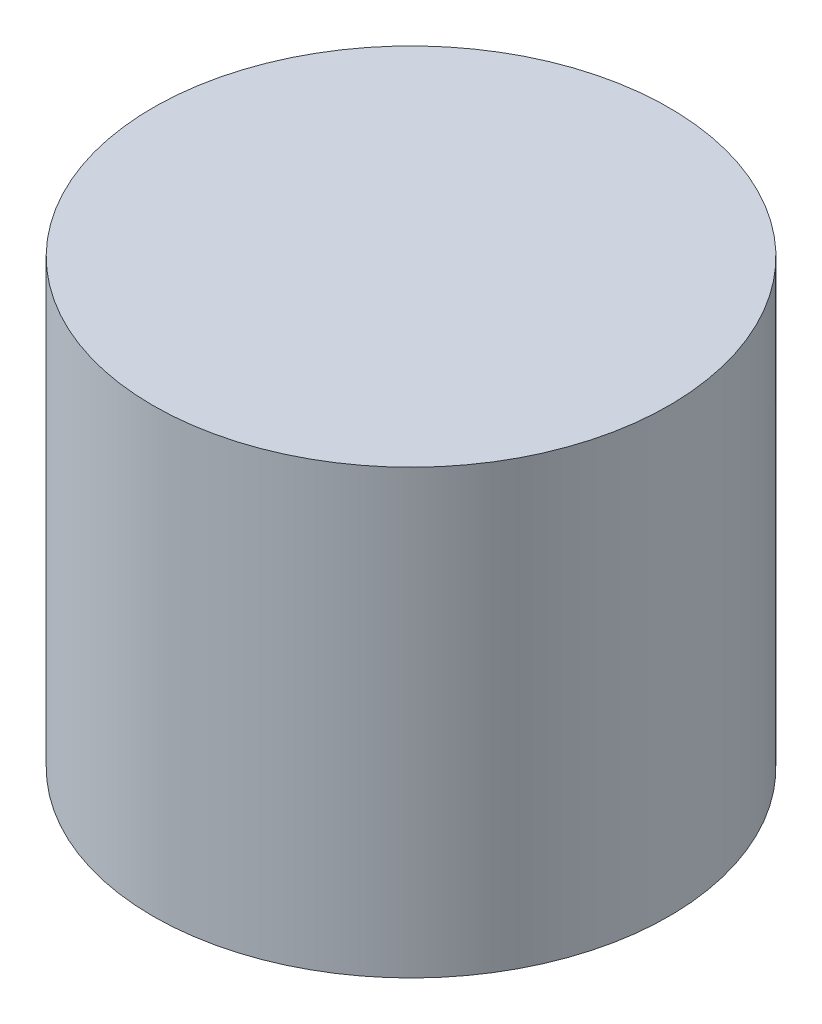
ISO-10303-21;
HEADER;
FILE_DESCRIPTION(('STEP AP214'),'2;1');
FILE_NAME('part.step','',(''),(''),'','','');
FILE_SCHEMA(('AUTOMOTIVE_DESIGN { 1 0 10303 214 1 1 1 1 }'));
ENDSEC;
DATA;
#1=APPLICATION_CONTEXT('core data for automotive mechanical design processes');
#2=APPLICATION_PROTOCOL_DEFINITION('international standard','automotive_design',2000,#1);
#3=PRODUCT_CONTEXT('',#1,'mechanical');
#4=PRODUCT('Part','Part','',(#3));
#5=PRODUCT_RELATED_PRODUCT_CATEGORY('part','',(#4));
#6=PRODUCT_DEFINITION_FORMATION('','',#4);
#7=PRODUCT_DEFINITION_CONTEXT('part definition',#1,'design');
#8=PRODUCT_DEFINITION('design','',#6,#7);
#9=PRODUCT_DEFINITION_SHAPE('','',#8);
#10=(LENGTH_UNIT() NAMED_UNIT(*) SI_UNIT(.MILLI.,.METRE.));
#11=(NAMED_UNIT(*) PLANE_ANGLE_UNIT() SI_UNIT($,.RADIAN.));
#12=(NAMED_UNIT(*) SI_UNIT($,.STERADIAN.) SOLID_ANGLE_UNIT());
#13=UNCERTAINTY_MEASURE_WITH_UNIT(LENGTH_MEASURE(1.E-05),#10,'distance_accuracy_value','');
#14=(GEOMETRIC_REPRESENTATION_CONTEXT(3) GLOBAL_UNCERTAINTY_ASSIGNED_CONTEXT((#13)) GLOBAL_UNIT_ASSIGNED_CONTEXT((#10,
#11,#12)) REPRESENTATION_CONTEXT('',''));
#15=CARTESIAN_POINT('',(0.,0.,0.));
#16=DIRECTION('',(0.,0.,1.));
#17=DIRECTION('',(1.,0.,0.));
#18=AXIS2_PLACEMENT_3D('',#15,#16,#17);
#19=CARTESIAN_POINT('',(0.,12.,0.));
#20=DIRECTION('',(0.,-1.,0.));
#21=DIRECTION('',(0.,0.,-1.));
#22=AXIS2_PLACEMENT_3D('',#19,#20,#21);
#23=CYLINDRICAL_SURFACE('',#22,7.);
#24=CARTESIAN_POINT('',(0.,12.,0.));
#25=DIRECTION('',(0.,1.,0.));
#26=DIRECTION('',(0.,0.,1.));
#27=AXIS2_PLACEMENT_3D('',#24,#25,#26);
#28=CIRCLE('',#27,7.);
#29=CARTESIAN_POINT('',(0.,12.,7.));
#30=VERTEX_POINT('',#29);
#31=EDGE_CURVE('E11',#30,#30,#28,.T.);
#32=ORIENTED_EDGE('',*,*,#31,.F.);
#33=EDGE_LOOP('',(#32));
#34=FACE_BOUND('',#33,.T.);
#35=CARTESIAN_POINT('',(0.,0.,0.));
#36=DIRECTION('',(0.,1.,0.));
#37=DIRECTION('',(0.,0.,1.));
#38=AXIS2_PLACEMENT_3D('',#35,#36,#37);
#39=CIRCLE('',#38,7.);
#40=CARTESIAN_POINT('',(0.,0.,7.));
#41=VERTEX_POINT('',#40);
#42=EDGE_CURVE('E46',#41,#41,#39,.T.);
#43=ORIENTED_EDGE('',*,*,#42,.T.);
#44=EDGE_LOOP('',(#43));
#45=FACE_BOUND('',#44,.T.);
#46=ADVANCED_FACE('F43',(#34,#45),#23,.T.);
#47=CARTESIAN_POINT('',(0.,12.,0.));
#48=DIRECTION('',(0.,1.,0.));
#49=DIRECTION('',(0.,0.,1.));
#50=AXIS2_PLACEMENT_3D('',#47,#48,#49);
#51=PLANE('',#50);
#52=ORIENTED_EDGE('',*,*,#31,.T.);
#53=EDGE_LOOP('',(#52));
#54=FACE_BOUND('',#53,.T.);
#55=ADVANCED_FACE('F103',(#54),#51,.T.);
#56=CARTESIAN_POINT('',(0.,0.,0.));
#57=DIRECTION('',(0.,1.,0.));
#58=DIRECTION('',(0.,0.,1.));
#59=AXIS2_PLACEMENT_3D('',#56,#57,#58);
#60=PLANE('',#59);
#61=DIRECTION('',(1.,0.,0.));
#62=VECTOR('',#61,1.);
#63=CARTESIAN_POINT('',(-2.75,0.,-1.));
#64=LINE('',#63,#62);
#65=CARTESIAN_POINT('',(-2.75,0.,-1.));
#66=VERTEX_POINT('',#65);
#67=CARTESIAN_POINT('',(2.75,0.,-1.));
#68=VERTEX_POINT('',#67);
#69=EDGE_CURVE('E78',#66,#68,#64,.T.);
#70=ORIENTED_EDGE('',*,*,#69,.F.);
#71=CARTESIAN_POINT('',(0.,0.,0.));
#72=DIRECTION('',(0.,-1.,0.));
#73=DIRECTION('',(0.,0.,1.));
#74=AXIS2_PLACEMENT_3D('',#71,#72,#73);
#75=CIRCLE('',#74,2.92617497767991);
#76=EDGE_CURVE('E58',#68,#66,#75,.T.);
#77=ORIENTED_EDGE('',*,*,#76,.F.);
#78=EDGE_LOOP('',(#70,#77));
#79=FACE_BOUND('',#78,.T.);
#80=ORIENTED_EDGE('',*,*,#42,.F.);
#81=EDGE_LOOP('',(#80));
#82=FACE_BOUND('',#81,.T.);
#83=ADVANCED_FACE('F83',(#79,#82),#60,.F.);
#84=CARTESIAN_POINT('',(0.,7.,0.));
#85=DIRECTION('',(0.,-1.,0.));
#86=DIRECTION('',(0.,0.,-1.));
#87=AXIS2_PLACEMENT_3D('',#84,#85,#86);
#88=CYLINDRICAL_SURFACE('',#87,2.92617497767991);
#89=ORIENTED_EDGE('',*,*,#76,.T.);
#90=DIRECTION('',(0.,-1.,0.));
#91=VECTOR('',#90,1.);
#92=CARTESIAN_POINT('',(-2.75,7.,-1.));
#93=LINE('',#92,#91);
#94=CARTESIAN_POINT('',(-2.75,7.,-1.));
#95=VERTEX_POINT('',#94);
#96=EDGE_CURVE('E75',#95,#66,#93,.T.);
#97=ORIENTED_EDGE('',*,*,#96,.F.);
#98=CARTESIAN_POINT('',(0.,7.,0.));
#99=DIRECTION('',(0.,-1.,0.));
#100=DIRECTION('',(0.,0.,1.));
#101=AXIS2_PLACEMENT_3D('',#98,#99,#100);
#102=CIRCLE('',#101,2.92617497767991);
#103=CARTESIAN_POINT('',(2.75,7.,-1.));
#104=VERTEX_POINT('',#103);
#105=EDGE_CURVE('E72',#104,#95,#102,.T.);
#106=ORIENTED_EDGE('',*,*,#105,.F.);
#107=DIRECTION('',(0.,-1.,0.));
#108=VECTOR('',#107,1.);
#109=CARTESIAN_POINT('',(2.75,7.,-1.));
#110=LINE('',#109,#108);
#111=EDGE_CURVE('E66',#104,#68,#110,.T.);
#112=ORIENTED_EDGE('',*,*,#111,.T.);
#113=EDGE_LOOP('',(#89,#97,#106,#112));
#114=FACE_BOUND('',#113,.T.);
#115=ADVANCED_FACE('F70',(#114),#88,.F.);
#116=CARTESIAN_POINT('',(-2.75,7.,-1.));
#117=DIRECTION('',(0.,0.,-1.));
#118=DIRECTION('',(-1.,0.,0.));
#119=AXIS2_PLACEMENT_3D('',#116,#117,#118);
#120=PLANE('',#119);
#121=ORIENTED_EDGE('',*,*,#69,.T.);
#122=ORIENTED_EDGE('',*,*,#111,.F.);
#123=DIRECTION('',(1.,0.,0.));
#124=VECTOR('',#123,1.);
#125=CARTESIAN_POINT('',(-2.75,7.,-1.));
#126=LINE('',#125,#124);
#127=EDGE_CURVE('E88',#95,#104,#126,.T.);
#128=ORIENTED_EDGE('',*,*,#127,.F.);
#129=ORIENTED_EDGE('',*,*,#96,.T.);
#130=EDGE_LOOP('',(#121,#122,#128,#129));
#131=FACE_BOUND('',#130,.T.);
#132=ADVANCED_FACE('F79',(#131),#120,.F.);
#133=CARTESIAN_POINT('',(0.,7.,0.));
#134=DIRECTION('',(0.,1.,0.));
#135=DIRECTION('',(0.,0.,1.));
#136=AXIS2_PLACEMENT_3D('',#133,#134,#135);
#137=PLANE('',#136);
#138=ORIENTED_EDGE('',*,*,#105,.T.);
#139=ORIENTED_EDGE('',*,*,#127,.T.);
#140=EDGE_LOOP('',(#138,#139));
#141=FACE_BOUND('',#140,.T.);
#142=ADVANCED_FACE('F95',(#141),#137,.F.);
#143=CLOSED_SHELL('',(#46,#55,#83,#115,#132,#142));
#144=MANIFOLD_SOLID_BREP('B2',#143);
#145=ADVANCED_BREP_SHAPE_REPRESENTATION('',(#18,#144),#14);
#146=SHAPE_DEFINITION_REPRESENTATION(#9,#145);
ENDSEC;
END-ISO-10303-21;
